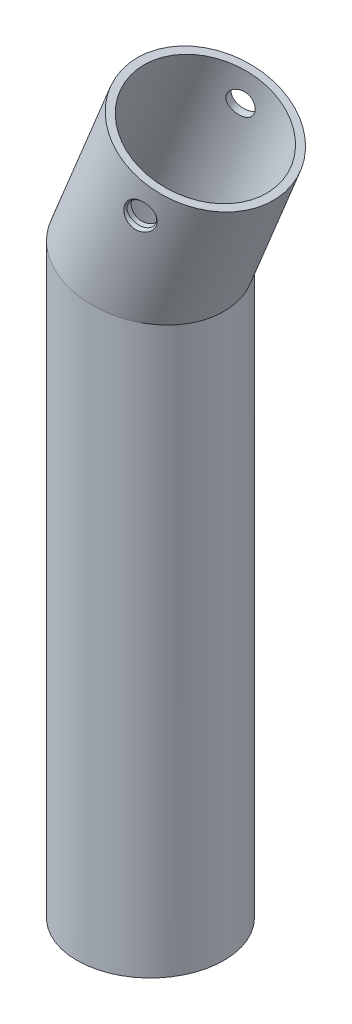
ISO-10303-21;
HEADER;
FILE_DESCRIPTION(('STEP AP214'),'2;1');
FILE_NAME('part.step','',(''),(''),'','','');
FILE_SCHEMA(('AUTOMOTIVE_DESIGN { 1 0 10303 214 1 1 1 1 }'));
ENDSEC;
DATA;
#1=APPLICATION_CONTEXT('core data for automotive mechanical design processes');
#2=APPLICATION_PROTOCOL_DEFINITION('international standard','automotive_design',2000,#1);
#3=PRODUCT_CONTEXT('',#1,'mechanical');
#4=PRODUCT('Part','Part','',(#3));
#5=PRODUCT_RELATED_PRODUCT_CATEGORY('part','',(#4));
#6=PRODUCT_DEFINITION_FORMATION('','',#4);
#7=PRODUCT_DEFINITION_CONTEXT('part definition',#1,'design');
#8=PRODUCT_DEFINITION('design','',#6,#7);
#9=PRODUCT_DEFINITION_SHAPE('','',#8);
#10=(LENGTH_UNIT() NAMED_UNIT(*) SI_UNIT(.MILLI.,.METRE.));
#11=(NAMED_UNIT(*) PLANE_ANGLE_UNIT() SI_UNIT($,.RADIAN.));
#12=(NAMED_UNIT(*) SI_UNIT($,.STERADIAN.) SOLID_ANGLE_UNIT());
#13=UNCERTAINTY_MEASURE_WITH_UNIT(LENGTH_MEASURE(1.E-05),#10,'distance_accuracy_value','');
#14=(GEOMETRIC_REPRESENTATION_CONTEXT(3) GLOBAL_UNCERTAINTY_ASSIGNED_CONTEXT((#13)) GLOBAL_UNIT_ASSIGNED_CONTEXT((#10,
#11,#12)) REPRESENTATION_CONTEXT('',''));
#15=CARTESIAN_POINT('',(0.,0.,0.));
#16=DIRECTION('',(0.,0.,1.));
#17=DIRECTION('',(1.,0.,0.));
#18=AXIS2_PLACEMENT_3D('',#15,#16,#17);
#19=CARTESIAN_POINT('',(-1.67566561410987,74.330210285197,0.));
#20=DIRECTION('',(0.378614753580007,0.92555435732946,0.));
#21=DIRECTION('',(-0.925554357329461,0.378614753580007,0.));
#22=AXIS2_PLACEMENT_3D('',#19,#20,#21);
#23=CYLINDRICAL_SURFACE('',#22,10.);
#24=CARTESIAN_POINT('',(5.03955450456209,93.5931023976665,-9.94173534170408));
#25=CARTESIAN_POINT('',(5.0386399297424,93.5014867696239,-9.94540529461607));
#26=CARTESIAN_POINT('',(5.03009068088098,93.4098629080274,-9.94813951995318));
#27=CARTESIAN_POINT('',(4.99779905164174,93.2292449721139,-9.95200129623015));
#28=CARTESIAN_POINT('',(4.97404521612904,93.1402529335437,-9.95312763371892));
#29=CARTESIAN_POINT('',(4.91195228631169,92.967512237948,-9.95389528452588));
#30=CARTESIAN_POINT('',(4.87361534279328,92.8837628098375,-9.95353681675317));
#31=CARTESIAN_POINT('',(4.78347810737577,92.7238963217778,-9.95129458451125));
#32=CARTESIAN_POINT('',(4.73167971884891,92.6477781849139,-9.94941103560032));
#33=CARTESIAN_POINT('',(4.61625543278558,92.5053552101745,-9.94392406276199));
#34=CARTESIAN_POINT('',(4.55264507386991,92.4390376831113,-9.94032288871511));
#35=CARTESIAN_POINT('',(4.41545153075679,92.3178450954678,-9.93108132309621));
#36=CARTESIAN_POINT('',(4.34186741304508,92.2629711071906,-9.92544074055909));
#37=CARTESIAN_POINT('',(4.18602208884039,92.1655295812701,-9.9116572378067));
#38=CARTESIAN_POINT('',(4.10367363496048,92.1231054024138,-9.90348723729415));
#39=CARTESIAN_POINT('',(3.93340094919107,92.0524727669124,-9.88426945712368));
#40=CARTESIAN_POINT('',(3.84547642592041,92.0242650538484,-9.87322152698376));
#41=CARTESIAN_POINT('',(3.66591836452652,91.9826374478521,-9.84783443973807));
#42=CARTESIAN_POINT('',(3.57426149734389,91.9693329817135,-9.83347061815191));
#43=CARTESIAN_POINT('',(3.39060463051784,91.9582723708194,-9.80134462182006));
#44=CARTESIAN_POINT('',(3.29860465003625,91.9605153704054,-9.78358263414557));
#45=CARTESIAN_POINT('',(3.11769266765541,91.9804207298166,-9.74489224480316));
#46=CARTESIAN_POINT('',(3.02876274047721,91.9979678561452,-9.72398847088563));
#47=CARTESIAN_POINT('',(2.85591385933533,92.0478315033594,-9.67928978159882));
#48=CARTESIAN_POINT('',(2.77199454209048,92.0801469520327,-9.65549507620951));
#49=CARTESIAN_POINT('',(2.6124844231473,92.1581799022743,-9.60595239682313));
#50=CARTESIAN_POINT('',(2.53681334927624,92.2037486487711,-9.5802283361767));
#51=CARTESIAN_POINT('',(2.3948518020765,92.3071166406404,-9.527509649257));
#52=CARTESIAN_POINT('',(2.32856147948691,92.3649160825105,-9.500515002576));
#53=CARTESIAN_POINT('',(2.20694318301915,92.4912842798113,-9.44629474128753));
#54=CARTESIAN_POINT('',(2.15164239889345,92.5598790118831,-9.41906872342126));
#55=CARTESIAN_POINT('',(2.05355922436233,92.7058727221947,-9.36568984080493));
#56=CARTESIAN_POINT('',(2.01077782645586,92.7832723977884,-9.33953706127919));
#57=CARTESIAN_POINT('',(1.93829180431497,92.9457989381685,-9.28929364002913));
#58=CARTESIAN_POINT('',(1.90875015127408,93.0310073376316,-9.26523148886405));
#59=CARTESIAN_POINT('',(1.86416522970669,93.206063738987,-9.22082560626497));
#60=CARTESIAN_POINT('',(1.84912231778015,93.2959118549369,-9.20048196629859));
#61=CARTESIAN_POINT('',(1.83381823717071,93.4781168034458,-9.16462595124903));
#62=CARTESIAN_POINT('',(1.83360526895984,93.5704808404313,-9.14912949296188));
#63=CARTESIAN_POINT('',(1.84802180344338,93.7548483753811,-9.12401085789385));
#64=CARTESIAN_POINT('',(1.86265011336752,93.8468519017226,-9.11438820914365));
#65=CARTESIAN_POINT('',(1.90604939173873,94.0268705035312,-9.10170161383906));
#66=CARTESIAN_POINT('',(1.93466564159552,94.1149179605391,-9.09856783637984));
#67=CARTESIAN_POINT('',(2.00513060335399,94.2855336019256,-9.09885129765306));
#68=CARTESIAN_POINT('',(2.04697863526339,94.3681020676103,-9.10226819978632));
#69=CARTESIAN_POINT('',(2.14232562450076,94.5247439235661,-9.11537926912093));
#70=CARTESIAN_POINT('',(2.19572838617489,94.5988801704843,-9.12502284022365));
#71=CARTESIAN_POINT('',(2.3129259658209,94.7373406649754,-9.14994348037249));
#72=CARTESIAN_POINT('',(2.37672129453462,94.8016644300138,-9.16522082633666));
#73=CARTESIAN_POINT('',(2.51353885899096,94.9191545080942,-9.20063805567584));
#74=CARTESIAN_POINT('',(2.58662573941171,94.9722349397223,-9.22081300631753));
#75=CARTESIAN_POINT('',(2.73978199027187,95.0651579417611,-9.26482441268905));
#76=CARTESIAN_POINT('',(2.81985187746678,95.1049995314217,-9.2886611394967));
#77=CARTESIAN_POINT('',(2.98588812380386,95.1706724953487,-9.33901258606776));
#78=CARTESIAN_POINT('',(3.07191073646074,95.1963410227082,-9.36555444364191));
#79=CARTESIAN_POINT('',(3.24679513251297,95.2321653687365,-9.41974056426886));
#80=CARTESIAN_POINT('',(3.33565687596761,95.2423214055359,-9.44738481181467));
#81=CARTESIAN_POINT('',(3.51364259384133,95.2467240718398,-9.50241910881268));
#82=CARTESIAN_POINT('',(3.60276555564273,95.2410057891859,-9.52980958483941));
#83=CARTESIAN_POINT('',(3.77898599511894,95.2138087957326,-9.58324383669551));
#84=CARTESIAN_POINT('',(3.86608364052764,95.1923313949119,-9.60928772426761));
#85=CARTESIAN_POINT('',(4.03473013600193,95.1345493271831,-9.65879434044897));
#86=CARTESIAN_POINT('',(4.11633294102212,95.0984252877415,-9.68228424258926));
#87=CARTESIAN_POINT('',(4.27277008466752,95.0124087947254,-9.72639691343613));
#88=CARTESIAN_POINT('',(4.34760474356269,94.962516993097,-9.7470198178344));
#89=CARTESIAN_POINT('',(4.48811371946683,94.8506229504773,-9.78498598145525));
#90=CARTESIAN_POINT('',(4.55381721319281,94.788660876525,-9.80233975279498));
#91=CARTESIAN_POINT('',(4.67448451678954,94.6543026169916,-9.83377960660929));
#92=CARTESIAN_POINT('',(4.72944567315982,94.5819038610652,-9.84786488188226));
#93=CARTESIAN_POINT('',(4.8275472085795,94.4279110362806,-9.87304521343276));
#94=CARTESIAN_POINT('',(4.8705537131918,94.3462262203626,-9.88410638325053));
#95=CARTESIAN_POINT('',(4.94261017615627,94.1766572289744,-9.90334374893401));
#96=CARTESIAN_POINT('',(4.97167162406353,94.0887782257054,-9.91152231834004));
#97=CARTESIAN_POINT('',(5.00927274679142,93.9327478012676,-9.92358516617881));
#98=CARTESIAN_POINT('',(5.02118866056277,93.8654326711135,-9.92803312104519));
#99=CARTESIAN_POINT('',(5.0366706311426,93.7297806828772,-9.93573938933501));
#100=CARTESIAN_POINT('',(5.04023673919243,93.6614438310676,-9.93899771005892));
#101=CARTESIAN_POINT('',(5.03955450456209,93.5931023976665,-9.94173534170408));
#102=B_SPLINE_CURVE_WITH_KNOTS('',3,(#24,#25,#26,#27,#28,#29,#30,#31,#32,#33,#34,#35,#36,#37,
#38,#39,#40,#41,#42,#43,#44,#45,#46,#47,#48,#49,#50,#51,#52,#53,#54,#55,#56,#57,#58,#59,#60,#61,
#62,#63,#64,#65,#66,#67,#68,#69,#70,#71,#72,#73,#74,#75,#76,#77,#78,#79,#80,#81,#82,#83,#84,#85,
#86,#87,#88,#89,#90,#91,#92,#93,#94,#95,#96,#97,#98,#99,#100,#101),.UNSPECIFIED.,.T.,.F.,(4,2,2,
2,2,2,2,2,2,2,2,2,2,2,2,2,2,2,2,2,2,2,2,2,2,2,2,2,2,2,2,2,2,2,2,2,2,2,4),(0.,0.274836562397668,
0.549880430755784,0.824883750051651,1.0998482065683,1.37445347802701,1.64908446949654,
1.92676378701326,2.20445762681986,2.48428766859823,2.76410230998525,3.04182808114241,
3.31953369200699,3.59423528416009,3.8689412899859,4.14431872137161,4.41971797793428,
4.69841986560961,4.97712860784874,5.25674317065306,5.53633526305336,5.81290250830006,
6.08945554283606,6.36378919577724,6.63813633489247,6.91450897308321,7.19090208074608,
7.47040812498577,7.74991023888313,8.02879504678995,8.30765667498612,8.58317909727841,
8.85868847496897,9.13329621893296,9.40797170918072,9.68560945800433,9.96301806219538,
10.1680359209824,10.3730525216062),.UNSPECIFIED.);
#103=CARTESIAN_POINT('',(5.03955450456209,93.5931023976665,-9.94173534170408));
#104=VERTEX_POINT('',#103);
#105=EDGE_CURVE('E72',#104,#104,#102,.T.);
#106=ORIENTED_EDGE('',*,*,#105,.F.);
#107=EDGE_LOOP('',(#106));
#108=FACE_BOUND('',#107,.T.);
#109=CARTESIAN_POINT('',(7.08207098678196,89.9717065338909,9.75866947218513));
#110=CARTESIAN_POINT('',(7.16064146037299,89.9127150278141,9.73739702252572));
#111=CARTESIAN_POINT('',(7.2441976051817,89.8609321703397,9.71423230168156));
#112=CARTESIAN_POINT('',(7.41864888089404,89.7738420021653,9.66460984916407));
#113=CARTESIAN_POINT('',(7.5095478135696,89.7385432911973,9.63815040774098));
#114=CARTESIAN_POINT('',(7.68938068163817,89.6873445324713,9.58471223615757));
#115=CARTESIAN_POINT('',(7.77803794021102,89.6703028191746,9.55788718870144));
#116=CARTESIAN_POINT('',(7.95659208260285,89.651694888453,9.50314152166957));
#117=CARTESIAN_POINT('',(8.04648879074947,89.6501265000562,9.47522105633743));
#118=CARTESIAN_POINT('',(8.22705636354561,89.6620814263954,9.41879489997049));
#119=CARTESIAN_POINT('',(8.31770634429385,89.6759093856594,9.39028874976594));
#120=CARTESIAN_POINT('',(8.49589313736665,89.718125382963,9.33439243657815));
#121=CARTESIAN_POINT('',(8.58342894099447,89.7465180934964,9.30700263477449));
#122=CARTESIAN_POINT('',(8.76045487709248,89.8193594972638,9.2523234065017));
#123=CARTESIAN_POINT('',(8.84954967332101,89.864902733962,9.22521412309755));
#124=CARTESIAN_POINT('',(9.02044476756259,89.9696739105459,9.1747314151125));
#125=CARTESIAN_POINT('',(9.10224223927788,90.0289071210225,9.15135943525855));
#126=CARTESIAN_POINT('',(9.26405103551442,90.1650547798215,9.10748507190149));
#127=CARTESIAN_POINT('',(9.34325332308064,90.2430746101412,9.08742413724656));
#128=CARTESIAN_POINT('',(9.48980103861727,90.4107990863928,9.05394577576602));
#129=CARTESIAN_POINT('',(9.5571430880967,90.5005070491699,9.04053023997325));
#130=CARTESIAN_POINT('',(9.68215666846945,90.6946642156133,9.02046440002934));
#131=CARTESIAN_POINT('',(9.73904151005966,90.7996664501153,9.01425125717796));
#132=CARTESIAN_POINT('',(9.83665162322093,91.0170853106051,9.01039219127847));
#133=CARTESIAN_POINT('',(9.8773744168476,91.1295030704528,9.01274758138443));
#134=CARTESIAN_POINT('',(9.94209831922151,91.3609351502466,9.02602008900654));
#135=CARTESIAN_POINT('',(9.96576124738881,91.4800349442306,9.0371017016457));
#136=CARTESIAN_POINT('',(9.99403152097356,91.7194863673875,9.06737593978098));
#137=CARTESIAN_POINT('',(9.99863712496692,91.839838109954,9.086569306338));
#138=CARTESIAN_POINT('',(9.98803238790001,92.0771114035315,9.13170128875864));
#139=CARTESIAN_POINT('',(9.97302761693978,92.1940556104635,9.15756768444635));
#140=CARTESIAN_POINT('',(9.92301655501742,92.4222670378061,9.21464640949984));
#141=CARTESIAN_POINT('',(9.88801413036686,92.5335353510557,9.24585770467547));
#142=CARTESIAN_POINT('',(9.80022752208759,92.7410671795963,9.31008317484613));
#143=CARTESIAN_POINT('',(9.74844792474834,92.8378076620479,9.34292266123475));
#144=CARTESIAN_POINT('',(9.627349326964,93.019097820389,9.40991535819752));
#145=CARTESIAN_POINT('',(9.55804393230608,93.1036568735085,9.44406753233239));
#146=CARTESIAN_POINT('',(9.41066980552277,93.2498044695239,9.50857962789123));
#147=CARTESIAN_POINT('',(9.33402079973686,93.3127996893487,9.53899621690489));
#148=CARTESIAN_POINT('',(9.16964278719552,93.4233137861529,9.5979064674328));
#149=CARTESIAN_POINT('',(9.08192047537361,93.4708419529189,9.62640127501896));
#150=CARTESIAN_POINT('',(8.90565262007786,93.5455026872496,9.67815828252703));
#151=CARTESIAN_POINT('',(8.81773552867748,93.573963729548,9.7016567771533));
#152=CARTESIAN_POINT('',(8.6376056856181,93.6155666343351,9.74547519311947));
#153=CARTESIAN_POINT('',(8.54539325384477,93.6287096357091,9.76579535066917));
#154=CARTESIAN_POINT('',(8.36012842295394,93.639620298647,9.80286344347183));
#155=CARTESIAN_POINT('',(8.26708791754249,93.6375052934787,9.81963762041731));
#156=CARTESIAN_POINT('',(8.08195554413065,93.618743964195,9.84987383445647));
#157=CARTESIAN_POINT('',(7.98986389555282,93.6020943520268,9.86333512121702));
#158=CARTESIAN_POINT('',(7.80303201899061,93.5536896355329,9.8879836891755));
#159=CARTESIAN_POINT('',(7.70849882088024,93.521036926252,9.89897058907433));
#160=CARTESIAN_POINT('',(7.52520583679161,93.4417088909383,9.91799103777484));
#161=CARTESIAN_POINT('',(7.4364482324897,93.3950283029848,9.92602347582568));
#162=CARTESIAN_POINT('',(7.25878372170092,93.2842731304379,9.94029359393853));
#163=CARTESIAN_POINT('',(7.17060608124074,93.2189979122385,9.94629983929816));
#164=CARTESIAN_POINT('',(7.00535778107443,93.0755072853931,9.95608008719207));
#165=CARTESIAN_POINT('',(6.92829089773927,92.9972874964027,9.95985333211133));
#166=CARTESIAN_POINT('',(6.78190220009864,92.823978636618,9.96590072765121));
#167=CARTESIAN_POINT('',(6.71352744885732,92.7280835017986,9.96804847871879));
#168=CARTESIAN_POINT('',(6.59319982944106,92.5264678017103,9.97079466690909));
#169=CARTESIAN_POINT('',(6.54125002923739,92.420745405601,9.97139281473564));
#170=CARTESIAN_POINT('',(6.45375883105867,92.1988404747036,9.9711625696898));
#171=CARTESIAN_POINT('',(6.41878558712716,92.0824333983881,9.9702886664545));
#172=CARTESIAN_POINT('',(6.36879712877382,91.8454193849474,9.96683286048554));
#173=CARTESIAN_POINT('',(6.35378358898879,91.7248120962917,9.96425081446442));
#174=CARTESIAN_POINT('',(6.34434676320126,91.4828779876299,9.95686854566037));
#175=CARTESIAN_POINT('',(6.34991745287754,91.3615513885189,9.95206897223392));
#176=CARTESIAN_POINT('',(6.3818842044716,91.121756256371,9.93948014254123));
#177=CARTESIAN_POINT('',(6.40828467811439,91.0032883342773,9.93169025310888));
#178=CARTESIAN_POINT('',(6.48042624098139,90.7772062289478,9.91253980079224));
#179=CARTESIAN_POINT('',(6.5254680339935,90.6693585195405,9.90131181877085));
#180=CARTESIAN_POINT('',(6.63400996833082,90.4641122051997,9.87439486148979));
#181=CARTESIAN_POINT('',(6.69747370978018,90.3666935082456,9.85871468463052));
#182=CARTESIAN_POINT('',(6.81506009024867,90.2191943873661,9.82894965702253));
#183=CARTESIAN_POINT('',(6.86419692719539,90.164775900164,9.81635561280837));
#184=CARTESIAN_POINT('',(6.96867191182743,90.0628282176474,9.78907533578238));
#185=CARTESIAN_POINT('',(7.02401018993592,90.0152991672737,9.77438905896681));
#186=CARTESIAN_POINT('',(7.08207098678196,89.9717065338909,9.75866947218513));
#187=B_SPLINE_CURVE_WITH_KNOTS('',3,(#109,#110,#111,#112,#113,#114,#115,#116,#117,#118,#119,
#120,#121,#122,#123,#124,#125,#126,#127,#128,#129,#130,#131,#132,#133,#134,#135,#136,#137,#138,
#139,#140,#141,#142,#143,#144,#145,#146,#147,#148,#149,#150,#151,#152,#153,#154,#155,#156,#157,
#158,#159,#160,#161,#162,#163,#164,#165,#166,#167,#168,#169,#170,#171,#172,#173,#174,#175,#176,
#177,#178,#179,#180,#181,#182,#183,#184,#185,#186),.UNSPECIFIED.,.T.,.F.,(4,2,2,2,2,2,2,2,2,2,2,
2,2,2,2,2,2,2,2,2,2,2,2,2,2,2,2,2,2,2,2,2,2,2,2,2,2,2,4),(0.,0.301281684577922,0.60272037184166,
0.883954220134254,1.16514860958354,1.45200739436456,1.73895826344082,2.04866064344676,
2.35848245697139,2.6959191753323,3.03345186052481,3.39054716280375,3.74769719334403,
4.11174574881855,4.4758275696622,4.83612326425608,5.196349323469,5.53809129389123,
5.87956877020163,6.18920511354485,6.49865513909121,6.78332479192693,7.06797327842936,
7.35043517935905,7.63296099604399,7.93354778583775,8.23424746813265,8.56245792607531,
8.89077967590337,9.24256427728892,9.59441454878278,9.95734349457951,10.3203028885136,
10.6831560646864,11.0460861133944,11.3964844118315,11.7461950180128,11.9688268277889,
12.1914633206368),.UNSPECIFIED.);
#188=CARTESIAN_POINT('',(7.08207098678196,89.9717065338909,9.75866947218513));
#189=VERTEX_POINT('',#188);
#190=EDGE_CURVE('E10',#189,#189,#187,.T.);
#191=ORIENTED_EDGE('',*,*,#190,.F.);
#192=EDGE_LOOP('',(#191));
#193=FACE_BOUND('',#192,.T.);
#194=CARTESIAN_POINT('',(0.,78.4265102732502,0.));
#195=DIRECTION('',(0.192932167704791,0.981212096676723,0.));
#196=DIRECTION('',(-0.981212096676723,0.192932167704791,0.));
#197=AXIS2_PLACEMENT_3D('',#194,#195,#196);
#198=ELLIPSE('',#197,10.1914764747287,10.);
#199=CARTESIAN_POINT('',(-10.,80.392773921632,0.));
#200=VERTEX_POINT('',#199);
#201=EDGE_CURVE('E69',#200,#200,#198,.F.);
#202=ORIENTED_EDGE('',*,*,#201,.F.);
#203=EDGE_LOOP('',(#202));
#204=FACE_BOUND('',#203,.T.);
#205=CARTESIAN_POINT('',(7.47137729557082,96.6908957621445,0.));
#206=DIRECTION('',(0.378614753580007,0.92555435732946,0.));
#207=DIRECTION('',(0.,0.,1.));
#208=AXIS2_PLACEMENT_3D('',#205,#206,#207);
#209=CIRCLE('',#208,10.);
#210=CARTESIAN_POINT('',(7.47137729557082,96.6908957621445,10.));
#211=VERTEX_POINT('',#210);
#212=EDGE_CURVE('E66',#211,#211,#209,.T.);
#213=ORIENTED_EDGE('',*,*,#212,.F.);
#214=EDGE_LOOP('',(#213));
#215=FACE_BOUND('',#214,.T.);
#216=ADVANCED_FACE('F37',(#108,#193,#204,#215),#23,.T.);
#217=CARTESIAN_POINT('',(0.,0.,0.));
#218=DIRECTION('',(0.,1.,0.));
#219=DIRECTION('',(0.,0.,1.));
#220=AXIS2_PLACEMENT_3D('',#217,#218,#219);
#221=CYLINDRICAL_SURFACE('',#220,10.);
#222=CARTESIAN_POINT('',(0.,0.,0.));
#223=DIRECTION('',(0.,1.,0.));
#224=DIRECTION('',(0.,0.,1.));
#225=AXIS2_PLACEMENT_3D('',#222,#223,#224);
#226=CIRCLE('',#225,10.);
#227=CARTESIAN_POINT('',(0.,0.,10.));
#228=VERTEX_POINT('',#227);
#229=EDGE_CURVE('E63',#228,#228,#226,.T.);
#230=ORIENTED_EDGE('',*,*,#229,.T.);
#231=EDGE_LOOP('',(#230));
#232=FACE_BOUND('',#231,.T.);
#233=ORIENTED_EDGE('',*,*,#201,.T.);
#234=EDGE_LOOP('',(#233));
#235=FACE_BOUND('',#234,.T.);
#236=ADVANCED_FACE('F127',(#232,#235),#221,.T.);
#237=CARTESIAN_POINT('',(7.47137729557082,96.6908957621445,0.));
#238=DIRECTION('',(0.378614753580007,0.92555435732946,0.));
#239=DIRECTION('',(0.,0.,1.));
#240=AXIS2_PLACEMENT_3D('',#237,#238,#239);
#241=PLANE('',#240);
#242=CARTESIAN_POINT('',(7.47137729557082,96.6908957621445,0.));
#243=DIRECTION('',(0.378614753580007,0.92555435732946,0.));
#244=DIRECTION('',(0.,0.,1.));
#245=AXIS2_PLACEMENT_3D('',#242,#243,#244);
#246=CIRCLE('',#245,9.);
#247=CARTESIAN_POINT('',(7.47137729557082,96.6908957621445,9.));
#248=VERTEX_POINT('',#247);
#249=EDGE_CURVE('E57',#248,#248,#246,.F.);
#250=ORIENTED_EDGE('',*,*,#249,.T.);
#251=EDGE_LOOP('',(#250));
#252=FACE_BOUND('',#251,.T.);
#253=ORIENTED_EDGE('',*,*,#212,.T.);
#254=EDGE_LOOP('',(#253));
#255=FACE_BOUND('',#254,.T.);
#256=ADVANCED_FACE('F124',(#252,#255),#241,.T.);
#257=CARTESIAN_POINT('',(0.,0.,0.));
#258=DIRECTION('',(0.,1.,0.));
#259=DIRECTION('',(0.,0.,1.));
#260=AXIS2_PLACEMENT_3D('',#257,#258,#259);
#261=PLANE('',#260);
#262=CARTESIAN_POINT('',(0.,0.,0.));
#263=DIRECTION('',(0.,1.,0.));
#264=DIRECTION('',(0.,0.,1.));
#265=AXIS2_PLACEMENT_3D('',#262,#263,#264);
#266=CIRCLE('',#265,9.);
#267=CARTESIAN_POINT('',(0.,0.,9.));
#268=VERTEX_POINT('',#267);
#269=EDGE_CURVE('E52',#268,#268,#266,.F.);
#270=ORIENTED_EDGE('',*,*,#269,.F.);
#271=EDGE_LOOP('',(#270));
#272=FACE_BOUND('',#271,.T.);
#273=ORIENTED_EDGE('',*,*,#229,.F.);
#274=EDGE_LOOP('',(#273));
#275=FACE_BOUND('',#274,.T.);
#276=ADVANCED_FACE('F118',(#272,#275),#261,.F.);
#277=CARTESIAN_POINT('',(-1.51188520023468,74.7305847404291,0.));
#278=DIRECTION('',(0.378614753580007,0.925554357329461,0.));
#279=DIRECTION('',(-0.925554357329461,0.378614753580007,0.));
#280=AXIS2_PLACEMENT_3D('',#277,#278,#279);
#281=CYLINDRICAL_SURFACE('',#280,9.);
#282=CARTESIAN_POINT('',(5.28254467989912,93.4937028706381,-8.96298816329878));
#283=CARTESIAN_POINT('',(5.28332099533786,93.5868196253899,-8.95984669631892));
#284=CARTESIAN_POINT('',(5.27619495830524,93.6800243812093,-8.95584083565609));
#285=CARTESIAN_POINT('',(5.24651709198421,93.8638848795212,-8.94564061018258));
#286=CARTESIAN_POINT('',(5.22394931912519,93.9545378865197,-8.93944398661132));
#287=CARTESIAN_POINT('',(5.164229623499,94.1306062402253,-8.92435673670133));
#288=CARTESIAN_POINT('',(5.12708734940024,94.2160250089571,-8.9154678935627));
#289=CARTESIAN_POINT('',(5.0394165252535,94.3792460699001,-8.89453155622231));
#290=CARTESIAN_POINT('',(4.98889080059078,94.4570499649479,-8.88248472870935));
#291=CARTESIAN_POINT('',(4.87582868842514,94.603002889897,-8.85486564693814));
#292=CARTESIAN_POINT('',(4.81326180454925,94.6711266248338,-8.83928442289898));
#293=CARTESIAN_POINT('',(4.67807175730944,94.7954313644187,-8.8045092145091));
#294=CARTESIAN_POINT('',(4.60544920212271,94.851613090811,-8.78531544862337));
#295=CARTESIAN_POINT('',(4.45330705763903,94.9496766744932,-8.74378053483141));
#296=CARTESIAN_POINT('',(4.3738876890335,94.9917324243023,-8.72148283481681));
#297=CARTESIAN_POINT('',(4.20969375459301,95.0612711588968,-8.67407340978529));
#298=CARTESIAN_POINT('',(4.12491954626552,95.0887551153966,-8.64896187254333));
#299=CARTESIAN_POINT('',(3.95332947744273,95.1281841453837,-8.5970166960013));
#300=CARTESIAN_POINT('',(3.86654295793007,95.1402836470992,-8.5702030545918));
#301=CARTESIAN_POINT('',(3.69246949395538,95.1492016230488,-8.51568188593759));
#302=CARTESIAN_POINT('',(3.60518252580767,95.1460193679507,-8.48797431609221));
#303=CARTESIAN_POINT('',(3.43169417862994,95.1244870114833,-8.43267842898051));
#304=CARTESIAN_POINT('',(3.3455068384081,95.1060171902928,-8.40509278644615));
#305=CARTESIAN_POINT('',(3.17710149141831,95.0543674358643,-8.35161861596388));
#306=CARTESIAN_POINT('',(3.09488386946419,95.0211860796917,-8.32573025245893));
#307=CARTESIAN_POINT('',(2.93533448688638,94.9405157427022,-8.27667720377123));
#308=CARTESIAN_POINT('',(2.85808766120351,94.8928321808903,-8.25355592481106));
#309=CARTESIAN_POINT('',(2.71174299225695,94.7846933511783,-8.21181392759961));
#310=CARTESIAN_POINT('',(2.64264507462144,94.7242381998535,-8.19319316827227));
#311=CARTESIAN_POINT('',(2.51451053276641,94.5923582384453,-8.16163068414639));
#312=CARTESIAN_POINT('',(2.45546063423819,94.5209481418681,-8.14868143061218));
#313=CARTESIAN_POINT('',(2.3489529394729,94.3691655695381,-8.12927816734707));
#314=CARTESIAN_POINT('',(2.30149385546132,94.2887940908685,-8.12282343580633));
#315=CARTESIAN_POINT('',(2.22015431386684,94.1227236432307,-8.11689193908475));
#316=CARTESIAN_POINT('',(2.18607961494223,94.0371234609755,-8.11731126426539));
#317=CARTESIAN_POINT('',(2.13148053011968,93.8619905548086,-8.1248455311214));
#318=CARTESIAN_POINT('',(2.11095575825712,93.7724579429882,-8.13196028206605));
#319=CARTESIAN_POINT('',(2.08413160381408,93.5924638048059,-8.15236223824101));
#320=CARTESIAN_POINT('',(2.07775927576284,93.5020094672668,-8.16561736452842));
#321=CARTESIAN_POINT('',(2.07924641696735,93.3221626643059,-8.19745748142924));
#322=CARTESIAN_POINT('',(2.08710704948983,93.2327702862795,-8.21604290758613));
#323=CARTESIAN_POINT('',(2.11713455583924,93.056256669716,-8.25770986217425));
#324=CARTESIAN_POINT('',(2.13948426335934,92.9691794720818,-8.28084618110525));
#325=CARTESIAN_POINT('',(2.198203128462,92.8007944436982,-8.33014168077214));
#326=CARTESIAN_POINT('',(2.23457333041463,92.7194870432685,-8.35630108659254));
#327=CARTESIAN_POINT('',(2.32100641229232,92.5639363875904,-8.41054682981504));
#328=CARTESIAN_POINT('',(2.37121424567013,92.489779808376,-8.4386510653391));
#329=CARTESIAN_POINT('',(2.48393593888904,92.3516037708148,-8.49510660573553));
#330=CARTESIAN_POINT('',(2.54644911783484,92.2875837519322,-8.52345789685459));
#331=CARTESIAN_POINT('',(2.68163537855118,92.1719625515193,-8.57888616895428));
#332=CARTESIAN_POINT('',(2.75422672953885,92.1202697533799,-8.60597126558265));
#333=CARTESIAN_POINT('',(2.90792358661114,92.0301881359133,-8.65801458914928));
#334=CARTESIAN_POINT('',(2.98902826829563,91.9917980299474,-8.68297302160271));
#335=CARTESIAN_POINT('',(3.1562142405921,91.9298859267098,-8.72963005925339));
#336=CARTESIAN_POINT('',(3.24220997695526,91.9061633285329,-8.75136940495172));
#337=CARTESIAN_POINT('',(3.41769767377023,91.8734069383167,-8.791537966854));
#338=CARTESIAN_POINT('',(3.50718966883191,91.8643732917227,-8.80996715028017));
#339=CARTESIAN_POINT('',(3.68717509640431,91.8612240107655,-8.84338122196433));
#340=CARTESIAN_POINT('',(3.77766957025946,91.8671256952855,-8.8583620896137));
#341=CARTESIAN_POINT('',(3.95696514809837,91.8937106454604,-8.88497297953477));
#342=CARTESIAN_POINT('',(4.04576609117783,91.9143953085503,-8.89660268487526));
#343=CARTESIAN_POINT('',(4.22041284947919,91.970425233154,-8.91698118530047));
#344=CARTESIAN_POINT('',(4.30619681993468,92.0059795498827,-8.9256855730498));
#345=CARTESIAN_POINT('',(4.47090679233003,92.0908618736366,-8.94044239219808));
#346=CARTESIAN_POINT('',(4.5498326573617,92.1401901555483,-8.94649477066477));
#347=CARTESIAN_POINT('',(4.69890630898511,92.2516961924169,-8.95648020572174));
#348=CARTESIAN_POINT('',(4.7689999881127,92.3139474977998,-8.9604006448112));
#349=CARTESIAN_POINT('',(4.89768745763094,92.4494722386429,-8.96652906042912));
#350=CARTESIAN_POINT('',(4.95628032204154,92.5227465607753,-8.96873689911098));
#351=CARTESIAN_POINT('',(5.05947632886972,92.6773162208024,-8.97175218915713));
#352=CARTESIAN_POINT('',(5.10423784977273,92.7585055785957,-8.97257601368171));
#353=CARTESIAN_POINT('',(5.17931002579345,92.9272524179733,-8.97301256733677));
#354=CARTESIAN_POINT('',(5.20963429867846,93.0148038084174,-8.9726264403575));
#355=CARTESIAN_POINT('',(5.24848161459122,93.167848233084,-8.97087332467806));
#356=CARTESIAN_POINT('',(5.26077055499112,93.2324166807067,-8.96982150875685));
#357=CARTESIAN_POINT('',(5.27752862505884,93.3625431500337,-8.96698552561765));
#358=CARTESIAN_POINT('',(5.28199775778934,93.4281011713504,-8.96520135868649));
#359=CARTESIAN_POINT('',(5.28254467989912,93.4937028706381,-8.96298816329878));
#360=B_SPLINE_CURVE_WITH_KNOTS('',3,(#282,#283,#284,#285,#286,#287,#288,#289,#290,#291,#292,
#293,#294,#295,#296,#297,#298,#299,#300,#301,#302,#303,#304,#305,#306,#307,#308,#309,#310,#311,
#312,#313,#314,#315,#316,#317,#318,#319,#320,#321,#322,#323,#324,#325,#326,#327,#328,#329,#330,
#331,#332,#333,#334,#335,#336,#337,#338,#339,#340,#341,#342,#343,#344,#345,#346,#347,#348,#349,
#350,#351,#352,#353,#354,#355,#356,#357,#358,#359),.UNSPECIFIED.,.T.,.F.,(4,2,2,2,2,2,2,2,2,2,2,
2,2,2,2,2,2,2,2,2,2,2,2,2,2,2,2,2,2,2,2,2,2,2,2,2,2,2,4),(0.,0.27927795502108,0.558844700124426,
0.838226676765334,1.11754971991482,1.39758973635488,1.67761282308324,1.95405032953915,
2.23046939954628,2.50409130255787,2.7777262644898,3.05352461583508,3.32934964887566,
3.60905227048218,3.88875233915751,4.16807998153682,4.44737657563875,4.72245521100943,
4.99752601052962,5.27117569878876,5.54484775357863,5.82204224671197,6.09925739172687,
6.37949470631872,6.65971651881371,6.93778583589228,7.21582825054258,7.48997863894408,
7.7641317418791,8.03860289605797,8.31309999942672,8.59159342755714,8.87009241396896,
9.15022218863087,9.4303745085024,9.70718860850299,9.98374108695688,10.1804953192903,
10.3772494745636),.UNSPECIFIED.);
#361=CARTESIAN_POINT('',(5.28254467989912,93.4937028706381,-8.96298816329878));
#362=VERTEX_POINT('',#361);
#363=EDGE_CURVE('E80',#362,#362,#360,.T.);
#364=ORIENTED_EDGE('',*,*,#363,.F.);
#365=EDGE_LOOP('',(#364));
#366=FACE_BOUND('',#365,.T.);
#367=CARTESIAN_POINT('',(9.53555784109285,91.75393089804,8.1678469639463));
#368=CARTESIAN_POINT('',(9.53200614835365,91.6636643177554,8.15355389951303));
#369=CARTESIAN_POINT('',(9.52133086799449,91.5731906352868,8.14206882972189));
#370=CARTESIAN_POINT('',(9.48605034571271,91.3943537356489,8.1254650688734));
#371=CARTESIAN_POINT('',(9.46143606308318,91.305991927025,8.12035051656945));
#372=CARTESIAN_POINT('',(9.39899059068832,91.1339276348182,8.11683434450882));
#373=CARTESIAN_POINT('',(9.36116029548839,91.0502248363208,8.11843227047863));
#374=CARTESIAN_POINT('',(9.27336500797403,90.8898853616074,8.12823445125309));
#375=CARTESIAN_POINT('',(9.22340143208995,90.8132478620333,8.1364379351884));
#376=CARTESIAN_POINT('',(9.11281015855709,90.6693148161238,8.15889517104504));
#377=CARTESIAN_POINT('',(9.05220049562887,90.6020038100776,8.1731387477188));
#378=CARTESIAN_POINT('',(8.9218480466613,90.4784190995741,8.20678904027267));
#379=CARTESIAN_POINT('',(8.8521042973308,90.4221465608117,8.22619630094376));
#380=CARTESIAN_POINT('',(8.70422663443099,90.3214862534432,8.26932975130709));
#381=CARTESIAN_POINT('',(8.62599079308992,90.2772720187145,8.29311151029017));
#382=CARTESIAN_POINT('',(8.46389118588221,90.2030139508981,8.34346997098144));
#383=CARTESIAN_POINT('',(8.38002704876905,90.1729710536137,8.37004685712398));
#384=CARTESIAN_POINT('',(8.20794741077188,90.1277500873754,8.42485861868837));
#385=CARTESIAN_POINT('',(8.11969782338457,90.1127177281013,8.45310697920683));
#386=CARTESIAN_POINT('',(7.94193433985763,90.0985750665284,8.50961640692342));
#387=CARTESIAN_POINT('',(7.85242052895638,90.0994636958535,8.53787747314168));
#388=CARTESIAN_POINT('',(7.67540527048956,90.1171698618695,8.59288147284029));
#389=CARTESIAN_POINT('',(7.58789292671472,90.1338425238,8.61963587146564));
#390=CARTESIAN_POINT('',(7.41653650442828,90.1824962954529,8.67086497135474));
#391=CARTESIAN_POINT('',(7.332692096384,90.2144760268705,8.69533987763536));
#392=CARTESIAN_POINT('',(7.17220117527939,90.2922878077184,8.74095465072511));
#393=CARTESIAN_POINT('',(7.0954734072128,90.3379289145318,8.76213473569485));
#394=CARTESIAN_POINT('',(6.95017077021215,90.4418621715391,8.80114188908313));
#395=CARTESIAN_POINT('',(6.8815960503347,90.5001545529726,8.81896889620311));
#396=CARTESIAN_POINT('',(6.75438684567114,90.6278614475168,8.85121198639687));
#397=CARTESIAN_POINT('',(6.69578084054455,90.6973067599393,8.86561834192715));
#398=CARTESIAN_POINT('',(6.59042631874293,90.845216483806,8.89111692981915));
#399=CARTESIAN_POINT('',(6.54367894585359,90.923681764182,8.90220884251544));
#400=CARTESIAN_POINT('',(6.4628325054966,91.0886598084345,8.92157099956819));
#401=CARTESIAN_POINT('',(6.42893010970733,91.1752741765352,8.92979722489351));
#402=CARTESIAN_POINT('',(6.37586847568828,91.3531074210949,8.94367786956343));
#403=CARTESIAN_POINT('',(6.35670973354377,91.4443264523787,8.94933220236797));
#404=CARTESIAN_POINT('',(6.33382771975217,91.6291925388095,8.95859151438168));
#405=CARTESIAN_POINT('',(6.33017154877964,91.7228483871581,8.9621875265356));
#406=CARTESIAN_POINT('',(6.33879282455974,91.9094725864279,8.96773547769663));
#407=CARTESIAN_POINT('',(6.35106867675881,92.0024410052139,8.96968758120177));
#408=CARTESIAN_POINT('',(6.39107478796585,92.1837205020549,8.97223279426599));
#409=CARTESIAN_POINT('',(6.41859851289931,92.2720769135535,8.97284353530219));
#410=CARTESIAN_POINT('',(6.48820769724692,92.442850305832,8.97286152530092));
#411=CARTESIAN_POINT('',(6.53029221550415,92.5252676700744,8.97226885203572));
#412=CARTESIAN_POINT('',(6.62725372471598,92.6810008459589,8.9697923645303));
#413=CARTESIAN_POINT('',(6.68199613863212,92.7544007639593,8.96792175441271));
#414=CARTESIAN_POINT('',(6.8028457758032,92.8910900852661,8.9626261309481));
#415=CARTESIAN_POINT('',(6.86895366503447,92.9543788956783,8.95920102649395));
#416=CARTESIAN_POINT('',(7.0111924844675,93.0697283469418,8.95034898566522));
#417=CARTESIAN_POINT('',(7.08740734852574,93.1216840925795,8.94490451192445));
#418=CARTESIAN_POINT('',(7.24715210820938,93.2123465734616,8.93153255044516));
#419=CARTESIAN_POINT('',(7.33068267719335,93.2510520875036,8.92360483396843));
#420=CARTESIAN_POINT('',(7.5038611595289,93.3146958726814,8.90466265862558));
#421=CARTESIAN_POINT('',(7.59357862573085,93.339432705628,8.89360632506689));
#422=CARTESIAN_POINT('',(7.77540903510264,93.3736377562191,8.8680724178168));
#423=CARTESIAN_POINT('',(7.86752194227982,93.3831062031438,8.85359489550401));
#424=CARTESIAN_POINT('',(8.05118587868428,93.3864989221776,8.82107411003988));
#425=CARTESIAN_POINT('',(8.14273772208754,93.3804599701892,8.80303937652558));
#426=CARTESIAN_POINT('',(8.32274193840681,93.3530657278014,8.76348066620941));
#427=CARTESIAN_POINT('',(8.41119463080048,93.3317120210329,8.74195705035549));
#428=CARTESIAN_POINT('',(8.58107974981782,93.2747279935739,8.69618683371466));
#429=CARTESIAN_POINT('',(8.66259637896108,93.2393125527799,8.67198500177127));
#430=CARTESIAN_POINT('',(8.81770700685174,93.1552334823982,8.62133248276696));
#431=CARTESIAN_POINT('',(8.8913014117742,93.1065705324665,8.59488191112423));
#432=CARTESIAN_POINT('',(9.02826130926383,92.9976344619518,8.54084960858114));
#433=CARTESIAN_POINT('',(9.09167011844042,92.9374130343568,8.51327332905309));
#434=CARTESIAN_POINT('',(9.20706302306616,92.8068736446342,8.4580626288273));
#435=CARTESIAN_POINT('',(9.25904434149624,92.7365532351803,8.43042819564105));
#436=CARTESIAN_POINT('',(9.35094066355016,92.5867387942091,8.37606653664329));
#437=CARTESIAN_POINT('',(9.39069109091625,92.5071379765022,8.34935564515964));
#438=CARTESIAN_POINT('',(9.45629454422865,92.3416526941554,8.29863474211352));
#439=CARTESIAN_POINT('',(9.48215768681479,92.2557728556306,8.27462277454325));
#440=CARTESIAN_POINT('',(9.51511848491383,92.100558059203,8.2357792750667));
#441=CARTESIAN_POINT('',(9.52518884002063,92.032046026025,8.2201136256129));
#442=CARTESIAN_POINT('',(9.53678462152748,91.8937077388273,8.19168557816241));
#443=CARTESIAN_POINT('',(9.53831016709753,91.8238815031497,8.17892313967853));
#444=CARTESIAN_POINT('',(9.53555784109285,91.75393089804,8.1678469639463));
#445=B_SPLINE_CURVE_WITH_KNOTS('',3,(#367,#368,#369,#370,#371,#372,#373,#374,#375,#376,#377,
#378,#379,#380,#381,#382,#383,#384,#385,#386,#387,#388,#389,#390,#391,#392,#393,#394,#395,#396,
#397,#398,#399,#400,#401,#402,#403,#404,#405,#406,#407,#408,#409,#410,#411,#412,#413,#414,#415,
#416,#417,#418,#419,#420,#421,#422,#423,#424,#425,#426,#427,#428,#429,#430,#431,#432,#433,#434,
#435,#436,#437,#438,#439,#440,#441,#442,#443,#444),.UNSPECIFIED.,.T.,.F.,(4,2,2,2,2,2,2,2,2,2,2,
2,2,2,2,2,2,2,2,2,2,2,2,2,2,2,2,2,2,2,2,2,2,2,2,2,2,2,4),(0.,0.274128563485298,0.54843512817049,
0.822723129190456,1.0969791254087,1.3707749291147,1.64459963092425,1.9221788050815,
2.19977630659472,2.48004303289148,2.76029095199403,3.03799128451875,3.31566661658793,
3.58962904191534,3.86359647514064,4.13833391939446,4.4130978524855,4.69191335280704,
4.97073823412873,5.25076874511508,5.53077123146103,5.80707064073527,6.08335219435242,
6.35682143763248,6.63030671070015,6.90622492681301,7.18216856597757,7.46199604620929,
7.74181932432488,8.02097961279611,8.30011103870041,8.57513175387496,8.85013836192395,
9.12394256888854,9.39781324022984,9.67522236999063,9.95242913701804,10.1648635315382,
10.3772949633395),.UNSPECIFIED.);
#446=CARTESIAN_POINT('',(9.53555784109285,91.75393089804,8.1678469639463));
#447=VERTEX_POINT('',#446);
#448=EDGE_CURVE('E73',#447,#447,#445,.T.);
#449=ORIENTED_EDGE('',*,*,#448,.F.);
#450=EDGE_LOOP('',(#449));
#451=FACE_BOUND('',#450,.T.);
#452=CARTESIAN_POINT('',(0.,78.4265102732502,0.));
#453=DIRECTION('',(0.192932167704791,0.981212096676723,0.));
#454=DIRECTION('',(-0.981212096676723,0.192932167704791,0.));
#455=AXIS2_PLACEMENT_3D('',#452,#453,#454);
#456=ELLIPSE('',#455,9.17232882725579,9.);
#457=CARTESIAN_POINT('',(-9.,80.1961475567938,0.));
#458=VERTEX_POINT('',#457);
#459=EDGE_CURVE('E48',#458,#458,#456,.T.);
#460=ORIENTED_EDGE('',*,*,#459,.F.);
#461=EDGE_LOOP('',(#460));
#462=FACE_BOUND('',#461,.T.);
#463=ORIENTED_EDGE('',*,*,#249,.F.);
#464=EDGE_LOOP('',(#463));
#465=FACE_BOUND('',#464,.T.);
#466=ADVANCED_FACE('F85',(#366,#451,#462,#465),#281,.F.);
#467=CARTESIAN_POINT('',(0.,0.,0.));
#468=DIRECTION('',(0.,1.,0.));
#469=DIRECTION('',(0.,0.,1.));
#470=AXIS2_PLACEMENT_3D('',#467,#468,#469);
#471=CYLINDRICAL_SURFACE('',#470,9.);
#472=ORIENTED_EDGE('',*,*,#269,.T.);
#473=EDGE_LOOP('',(#472));
#474=FACE_BOUND('',#473,.T.);
#475=ORIENTED_EDGE('',*,*,#459,.T.);
#476=EDGE_LOOP('',(#475));
#477=FACE_BOUND('',#476,.T.);
#478=ADVANCED_FACE('F93',(#474,#477),#471,.F.);
#479=CARTESIAN_POINT('',(8.2055640090521,91.6429129586103,9.65856657768353));
#480=DIRECTION('',(0.239789890382069,-0.098090392572877,0.965856657768353));
#481=DIRECTION('',(0.970537063796715,0.,-0.240951878591663));
#482=AXIS2_PLACEMENT_3D('',#479,#480,#481);
#483=CYLINDRICAL_SURFACE('',#482,1.64999999999999);
#484=ORIENTED_EDGE('',*,*,#448,.T.);
#485=EDGE_LOOP('',(#484));
#486=FACE_BOUND('',#485,.T.);
#487=CARTESIAN_POINT('',(8.11564280015883,91.6796968558251,9.2963703310204));
#488=DIRECTION('',(0.239789890382069,-0.098090392572877,0.965856657768353));
#489=DIRECTION('',(0.970537063796715,0.,-0.240951878591663));
#490=AXIS2_PLACEMENT_3D('',#487,#488,#489);
#491=CIRCLE('',#490,1.65);
#492=CARTESIAN_POINT('',(9.71702895542341,91.6796968558251,8.89879973134415));
#493=VERTEX_POINT('',#492);
#494=EDGE_CURVE('E81',#493,#493,#491,.T.);
#495=ORIENTED_EDGE('',*,*,#494,.T.);
#496=EDGE_LOOP('',(#495));
#497=FACE_BOUND('',#496,.T.);
#498=ADVANCED_FACE('F89',(#486,#497),#483,.F.);
#499=CARTESIAN_POINT('',(8.2055640090521,91.6429129586103,9.65856657768353));
#500=DIRECTION('',(0.239789890382069,-0.098090392572877,0.965856657768353));
#501=DIRECTION('',(0.970537063796715,0.,-0.240951878591663));
#502=AXIS2_PLACEMENT_3D('',#499,#500,#501);
#503=CONICAL_SURFACE('',#502,2.025,0.785398163397437);
#504=ORIENTED_EDGE('',*,*,#190,.T.);
#505=EDGE_LOOP('',(#504));
#506=FACE_BOUND('',#505,.T.);
#507=ORIENTED_EDGE('',*,*,#494,.F.);
#508=EDGE_LOOP('',(#507));
#509=FACE_BOUND('',#508,.T.);
#510=ADVANCED_FACE('F92',(#506,#509),#503,.F.);
#511=ORIENTED_EDGE('',*,*,#105,.T.);
#512=EDGE_LOOP('',(#511));
#513=FACE_BOUND('',#512,.T.);
#514=ORIENTED_EDGE('',*,*,#363,.T.);
#515=EDGE_LOOP('',(#514));
#516=FACE_BOUND('',#515,.T.);
#517=ADVANCED_FACE('F95',(#513,#516),#483,.F.);
#518=CLOSED_SHELL('',(#216,#236,#256,#276,#466,#478,#498,#510,#517));
#519=MANIFOLD_SOLID_BREP('B2',#518);
#520=ADVANCED_BREP_SHAPE_REPRESENTATION('',(#18,#519),#14);
#521=SHAPE_DEFINITION_REPRESENTATION(#9,#520);
ENDSEC;
END-ISO-10303-21;
